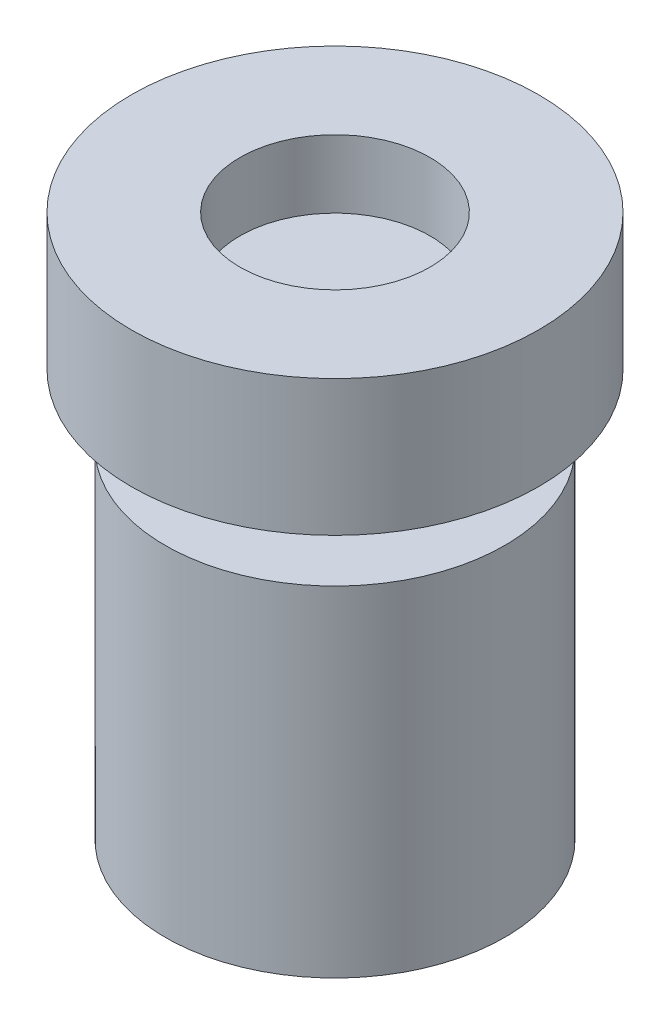
ISO-10303-21;
HEADER;
FILE_DESCRIPTION(('STEP AP214'),'2;1');
FILE_NAME('part.step','',(''),(''),'','','');
FILE_SCHEMA(('AUTOMOTIVE_DESIGN { 1 0 10303 214 1 1 1 1 }'));
ENDSEC;
DATA;
#1=APPLICATION_CONTEXT('core data for automotive mechanical design processes');
#2=APPLICATION_PROTOCOL_DEFINITION('international standard','automotive_design',2000,#1);
#3=PRODUCT_CONTEXT('',#1,'mechanical');
#4=PRODUCT('Part','Part','',(#3));
#5=PRODUCT_RELATED_PRODUCT_CATEGORY('part','',(#4));
#6=PRODUCT_DEFINITION_FORMATION('','',#4);
#7=PRODUCT_DEFINITION_CONTEXT('part definition',#1,'design');
#8=PRODUCT_DEFINITION('design','',#6,#7);
#9=PRODUCT_DEFINITION_SHAPE('','',#8);
#10=(LENGTH_UNIT() NAMED_UNIT(*) SI_UNIT(.MILLI.,.METRE.));
#11=(NAMED_UNIT(*) PLANE_ANGLE_UNIT() SI_UNIT($,.RADIAN.));
#12=(NAMED_UNIT(*) SI_UNIT($,.STERADIAN.) SOLID_ANGLE_UNIT());
#13=UNCERTAINTY_MEASURE_WITH_UNIT(LENGTH_MEASURE(1.E-05),#10,'distance_accuracy_value','');
#14=(GEOMETRIC_REPRESENTATION_CONTEXT(3) GLOBAL_UNCERTAINTY_ASSIGNED_CONTEXT((#13)) GLOBAL_UNIT_ASSIGNED_CONTEXT((#10,
#11,#12)) REPRESENTATION_CONTEXT('',''));
#15=CARTESIAN_POINT('',(0.,0.,0.));
#16=DIRECTION('',(0.,0.,1.));
#17=DIRECTION('',(1.,0.,0.));
#18=AXIS2_PLACEMENT_3D('',#15,#16,#17);
#19=CARTESIAN_POINT('',(-0.522013311509166,2.,-0.51113803418606));
#20=DIRECTION('',(0.,1.,0.));
#21=DIRECTION('',(0.,0.,1.));
#22=AXIS2_PLACEMENT_3D('',#19,#20,#21);
#23=PLANE('',#22);
#24=CARTESIAN_POINT('',(-0.522013311509166,2.,-0.51113803418606));
#25=DIRECTION('',(0.,1.,0.));
#26=DIRECTION('',(0.,0.,1.));
#27=AXIS2_PLACEMENT_3D('',#24,#25,#26);
#28=CIRCLE('',#27,3.);
#29=CARTESIAN_POINT('',(-0.522013311509166,2.,2.48886196581394));
#30=VERTEX_POINT('',#29);
#31=EDGE_CURVE('E57',#30,#30,#28,.T.);
#32=ORIENTED_EDGE('',*,*,#31,.T.);
#33=EDGE_LOOP('',(#32));
#34=FACE_BOUND('',#33,.T.);
#35=CARTESIAN_POINT('',(-0.522013311509166,2.,-0.51113803418606));
#36=DIRECTION('',(0.,1.,0.));
#37=DIRECTION('',(0.,0.,1.));
#38=AXIS2_PLACEMENT_3D('',#35,#36,#37);
#39=CIRCLE('',#38,1.4);
#40=CARTESIAN_POINT('',(-0.522013311509166,2.,0.88886196581394));
#41=VERTEX_POINT('',#40);
#42=EDGE_CURVE('E62',#41,#41,#39,.T.);
#43=ORIENTED_EDGE('',*,*,#42,.F.);
#44=EDGE_LOOP('',(#43));
#45=FACE_BOUND('',#44,.T.);
#46=ADVANCED_FACE('F43',(#34,#45),#23,.T.);
#47=CARTESIAN_POINT('',(-0.522013311509166,0.,-0.51113803418606));
#48=DIRECTION('',(0.,1.,0.));
#49=DIRECTION('',(0.,0.,1.));
#50=AXIS2_PLACEMENT_3D('',#47,#48,#49);
#51=PLANE('',#50);
#52=CARTESIAN_POINT('',(-0.522013311509166,0.,-0.51113803418606));
#53=DIRECTION('',(0.,-1.,0.));
#54=DIRECTION('',(0.,0.,-1.));
#55=AXIS2_PLACEMENT_3D('',#52,#53,#54);
#56=CIRCLE('',#55,1.5);
#57=CARTESIAN_POINT('',(-0.522013311509166,0.,-2.01113803418606));
#58=VERTEX_POINT('',#57);
#59=EDGE_CURVE('E10',#58,#58,#56,.T.);
#60=ORIENTED_EDGE('',*,*,#59,.F.);
#61=EDGE_LOOP('',(#60));
#62=FACE_BOUND('',#61,.T.);
#63=CARTESIAN_POINT('',(-0.522013311509166,0.,-0.51113803418606));
#64=DIRECTION('',(0.,1.,0.));
#65=DIRECTION('',(0.,0.,1.));
#66=AXIS2_PLACEMENT_3D('',#63,#64,#65);
#67=CIRCLE('',#66,3.);
#68=CARTESIAN_POINT('',(-0.522013311509166,0.,2.48886196581394));
#69=VERTEX_POINT('',#68);
#70=EDGE_CURVE('E66',#69,#69,#67,.T.);
#71=ORIENTED_EDGE('',*,*,#70,.F.);
#72=EDGE_LOOP('',(#71));
#73=FACE_BOUND('',#72,.T.);
#74=ADVANCED_FACE('F74',(#62,#73),#51,.F.);
#75=CARTESIAN_POINT('',(-0.522013311509166,2.,-0.51113803418606));
#76=DIRECTION('',(0.,-1.,0.));
#77=DIRECTION('',(0.,0.,-1.));
#78=AXIS2_PLACEMENT_3D('',#75,#76,#77);
#79=CYLINDRICAL_SURFACE('',#78,3.);
#80=ORIENTED_EDGE('',*,*,#31,.F.);
#81=EDGE_LOOP('',(#80));
#82=FACE_BOUND('',#81,.T.);
#83=ORIENTED_EDGE('',*,*,#70,.T.);
#84=EDGE_LOOP('',(#83));
#85=FACE_BOUND('',#84,.T.);
#86=ADVANCED_FACE('F45',(#82,#85),#79,.T.);
#87=CARTESIAN_POINT('',(-0.522013311509166,2.,-0.51113803418606));
#88=DIRECTION('',(0.,-1.,0.));
#89=DIRECTION('',(0.,0.,-1.));
#90=AXIS2_PLACEMENT_3D('',#87,#88,#89);
#91=CYLINDRICAL_SURFACE('',#90,1.4);
#92=CARTESIAN_POINT('',(-0.522013311509166,1.,-0.51113803418606));
#93=DIRECTION('',(0.,1.,0.));
#94=DIRECTION('',(0.,0.,1.));
#95=AXIS2_PLACEMENT_3D('',#92,#93,#94);
#96=CIRCLE('',#95,1.4);
#97=CARTESIAN_POINT('',(-0.522013311509166,1.,0.88886196581394));
#98=VERTEX_POINT('',#97);
#99=EDGE_CURVE('E47',#98,#98,#96,.T.);
#100=ORIENTED_EDGE('',*,*,#99,.F.);
#101=EDGE_LOOP('',(#100));
#102=FACE_BOUND('',#101,.T.);
#103=ORIENTED_EDGE('',*,*,#42,.T.);
#104=EDGE_LOOP('',(#103));
#105=FACE_BOUND('',#104,.T.);
#106=ADVANCED_FACE('F81',(#102,#105),#91,.F.);
#107=CARTESIAN_POINT('',(0.,1.,0.));
#108=DIRECTION('',(0.,1.,0.));
#109=DIRECTION('',(0.,0.,1.));
#110=AXIS2_PLACEMENT_3D('',#107,#108,#109);
#111=PLANE('',#110);
#112=ORIENTED_EDGE('',*,*,#99,.T.);
#113=EDGE_LOOP('',(#112));
#114=FACE_BOUND('',#113,.T.);
#115=ADVANCED_FACE('F88',(#114),#111,.T.);
#116=CARTESIAN_POINT('',(-0.522013311509166,-1.,-0.51113803418606));
#117=DIRECTION('',(0.,1.,0.));
#118=DIRECTION('',(0.,0.,1.));
#119=AXIS2_PLACEMENT_3D('',#116,#117,#118);
#120=CYLINDRICAL_SURFACE('',#119,1.5);
#121=CARTESIAN_POINT('',(-0.522013311509166,-1.,-0.51113803418606));
#122=DIRECTION('',(0.,-1.,0.));
#123=DIRECTION('',(0.,0.,-1.));
#124=AXIS2_PLACEMENT_3D('',#121,#122,#123);
#125=CIRCLE('',#124,1.5);
#126=CARTESIAN_POINT('',(-0.522013311509166,-1.,-2.01113803418606));
#127=VERTEX_POINT('',#126);
#128=EDGE_CURVE('E60',#127,#127,#125,.T.);
#129=ORIENTED_EDGE('',*,*,#128,.F.);
#130=EDGE_LOOP('',(#129));
#131=FACE_BOUND('',#130,.T.);
#132=ORIENTED_EDGE('',*,*,#59,.T.);
#133=EDGE_LOOP('',(#132));
#134=FACE_BOUND('',#133,.T.);
#135=ADVANCED_FACE('F92',(#131,#134),#120,.T.);
#136=CARTESIAN_POINT('',(-0.522013311509166,-6.,-0.51113803418606));
#137=DIRECTION('',(0.,1.,0.));
#138=DIRECTION('',(0.,0.,1.));
#139=AXIS2_PLACEMENT_3D('',#136,#137,#138);
#140=CYLINDRICAL_SURFACE('',#139,2.5);
#141=CARTESIAN_POINT('',(-0.522013311509166,-6.,-0.51113803418606));
#142=DIRECTION('',(0.,-1.,0.));
#143=DIRECTION('',(0.,0.,-1.));
#144=AXIS2_PLACEMENT_3D('',#141,#142,#143);
#145=CIRCLE('',#144,2.5);
#146=CARTESIAN_POINT('',(-0.522013311509166,-6.,-3.01113803418606));
#147=VERTEX_POINT('',#146);
#148=EDGE_CURVE('E112',#147,#147,#145,.T.);
#149=ORIENTED_EDGE('',*,*,#148,.F.);
#150=EDGE_LOOP('',(#149));
#151=FACE_BOUND('',#150,.T.);
#152=CARTESIAN_POINT('',(-0.522013311509166,-1.,-0.51113803418606));
#153=DIRECTION('',(0.,-1.,0.));
#154=DIRECTION('',(0.,0.,-1.));
#155=AXIS2_PLACEMENT_3D('',#152,#153,#154);
#156=CIRCLE('',#155,2.5);
#157=CARTESIAN_POINT('',(-0.522013311509166,-1.,-3.01113803418606));
#158=VERTEX_POINT('',#157);
#159=EDGE_CURVE('E114',#158,#158,#156,.T.);
#160=ORIENTED_EDGE('',*,*,#159,.T.);
#161=EDGE_LOOP('',(#160));
#162=FACE_BOUND('',#161,.T.);
#163=ADVANCED_FACE('F96',(#151,#162),#140,.T.);
#164=CARTESIAN_POINT('',(-0.522013311509166,-6.,-0.51113803418606));
#165=DIRECTION('',(0.,-1.,0.));
#166=DIRECTION('',(0.,0.,-1.));
#167=AXIS2_PLACEMENT_3D('',#164,#165,#166);
#168=PLANE('',#167);
#169=ORIENTED_EDGE('',*,*,#148,.T.);
#170=EDGE_LOOP('',(#169));
#171=FACE_BOUND('',#170,.T.);
#172=ADVANCED_FACE('F100',(#171),#168,.T.);
#173=CARTESIAN_POINT('',(-0.522013311509166,-1.,-0.51113803418606));
#174=DIRECTION('',(0.,-1.,0.));
#175=DIRECTION('',(0.,0.,-1.));
#176=AXIS2_PLACEMENT_3D('',#173,#174,#175);
#177=PLANE('',#176);
#178=ORIENTED_EDGE('',*,*,#128,.T.);
#179=EDGE_LOOP('',(#178));
#180=FACE_BOUND('',#179,.T.);
#181=ORIENTED_EDGE('',*,*,#159,.F.);
#182=EDGE_LOOP('',(#181));
#183=FACE_BOUND('',#182,.T.);
#184=ADVANCED_FACE('F102',(#180,#183),#177,.F.);
#185=CLOSED_SHELL('',(#46,#74,#86,#106,#115,#135,#163,#172,#184));
#186=MANIFOLD_SOLID_BREP('B2',#185);
#187=ADVANCED_BREP_SHAPE_REPRESENTATION('',(#18,#186),#14);
#188=SHAPE_DEFINITION_REPRESENTATION(#9,#187);
ENDSEC;
END-ISO-10303-21;
